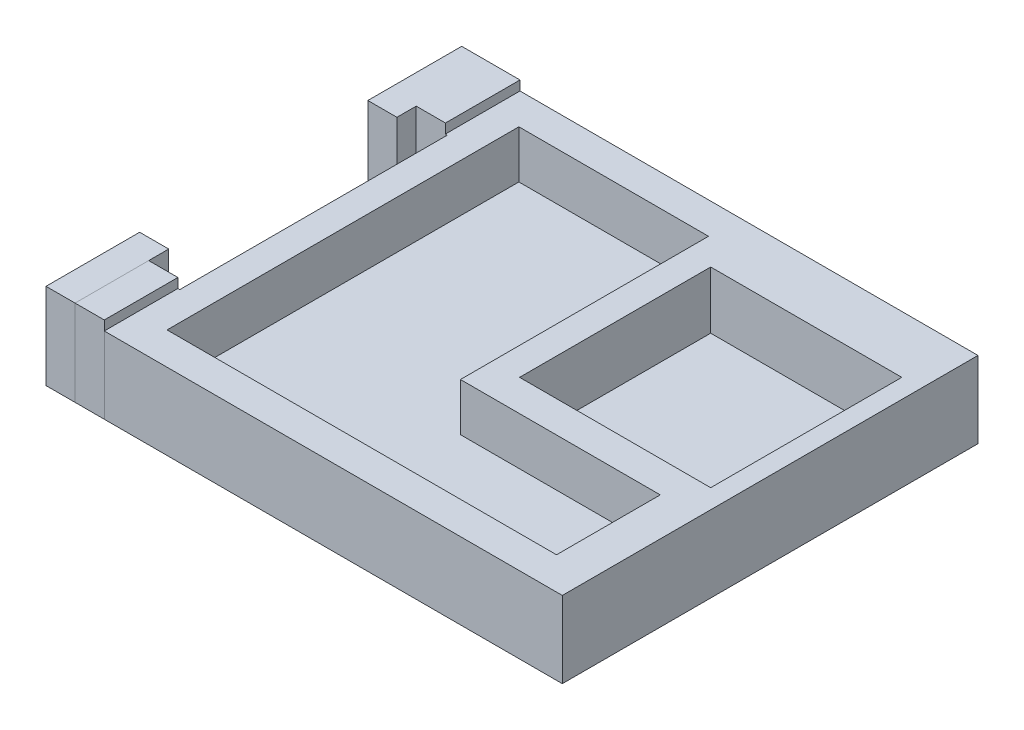
ISO-10303-21;
HEADER;
FILE_DESCRIPTION(('STEP AP214'),'2;1');
FILE_NAME('part.step','',(''),(''),'','','');
FILE_SCHEMA(('AUTOMOTIVE_DESIGN { 1 0 10303 214 1 1 1 1 }'));
ENDSEC;
DATA;
#1=APPLICATION_CONTEXT('core data for automotive mechanical design processes');
#2=APPLICATION_PROTOCOL_DEFINITION('international standard','automotive_design',2000,#1);
#3=PRODUCT_CONTEXT('',#1,'mechanical');
#4=PRODUCT('Part','Part','',(#3));
#5=PRODUCT_RELATED_PRODUCT_CATEGORY('part','',(#4));
#6=PRODUCT_DEFINITION_FORMATION('','',#4);
#7=PRODUCT_DEFINITION_CONTEXT('part definition',#1,'design');
#8=PRODUCT_DEFINITION('design','',#6,#7);
#9=PRODUCT_DEFINITION_SHAPE('','',#8);
#10=(LENGTH_UNIT() NAMED_UNIT(*) SI_UNIT(.MILLI.,.METRE.));
#11=(NAMED_UNIT(*) PLANE_ANGLE_UNIT() SI_UNIT($,.RADIAN.));
#12=(NAMED_UNIT(*) SI_UNIT($,.STERADIAN.) SOLID_ANGLE_UNIT());
#13=UNCERTAINTY_MEASURE_WITH_UNIT(LENGTH_MEASURE(1.E-05),#10,'distance_accuracy_value','');
#14=(GEOMETRIC_REPRESENTATION_CONTEXT(3) GLOBAL_UNCERTAINTY_ASSIGNED_CONTEXT((#13)) GLOBAL_UNIT_ASSIGNED_CONTEXT((#10,
#11,#12)) REPRESENTATION_CONTEXT('',''));
#15=CARTESIAN_POINT('',(0.,0.,0.));
#16=DIRECTION('',(0.,0.,1.));
#17=DIRECTION('',(1.,0.,0.));
#18=AXIS2_PLACEMENT_3D('',#15,#16,#17);
#19=CARTESIAN_POINT('',(-51.7142218353423,7.00000000000001,1.78412162468005));
#20=DIRECTION('',(0.,1.,0.));
#21=DIRECTION('',(0.,0.,-1.));
#22=AXIS2_PLACEMENT_3D('',#19,#20,#21);
#23=PLANE('',#22);
#24=DIRECTION('',(1.,0.,0.));
#25=VECTOR('',#24,1.);
#26=CARTESIAN_POINT('',(-54.9142218353423,6.99999999999999,-31.7158783753189));
#27=LINE('',#26,#25);
#28=CARTESIAN_POINT('',(-54.9142218353423,6.99999999999999,-31.7158783753189));
#29=VERTEX_POINT('',#28);
#30=CARTESIAN_POINT('',(-48.8142218353423,6.99999999999999,-31.7158783753189));
#31=VERTEX_POINT('',#30);
#32=EDGE_CURVE('E55',#29,#31,#27,.T.);
#33=ORIENTED_EDGE('',*,*,#32,.F.);
#34=DIRECTION('',(0.,0.,1.));
#35=VECTOR('',#34,1.);
#36=CARTESIAN_POINT('',(-54.9142218353423,6.99999999999999,-31.7158783753189));
#37=LINE('',#36,#35);
#38=CARTESIAN_POINT('',(-54.9142218353423,7.,-21.8957467152052));
#39=VERTEX_POINT('',#38);
#40=EDGE_CURVE('E88',#29,#39,#37,.T.);
#41=ORIENTED_EDGE('',*,*,#40,.T.);
#42=DIRECTION('',(1.,0.,0.));
#43=VECTOR('',#42,1.);
#44=CARTESIAN_POINT('',(-54.9142218353423,7.,-21.8957467152052));
#45=LINE('',#44,#43);
#46=CARTESIAN_POINT('',(-51.8720248838093,7.,-21.8957467152052));
#47=VERTEX_POINT('',#46);
#48=EDGE_CURVE('E82',#39,#47,#45,.T.);
#49=ORIENTED_EDGE('',*,*,#48,.T.);
#50=DIRECTION('',(0.,0.,1.));
#51=VECTOR('',#50,1.);
#52=CARTESIAN_POINT('',(-51.8720248838093,7.,-23.9158783753189));
#53=LINE('',#52,#51);
#54=CARTESIAN_POINT('',(-51.8720248838093,7.,-23.9158783753189));
#55=VERTEX_POINT('',#54);
#56=EDGE_CURVE('E85',#55,#47,#53,.T.);
#57=ORIENTED_EDGE('',*,*,#56,.F.);
#58=DIRECTION('',(1.,0.,0.));
#59=VECTOR('',#58,1.);
#60=CARTESIAN_POINT('',(-51.8720248838093,7.,-23.9158783753189));
#61=LINE('',#60,#59);
#62=CARTESIAN_POINT('',(-48.8142218353423,7.,-23.9158783753189));
#63=VERTEX_POINT('',#62);
#64=EDGE_CURVE('E68',#55,#63,#61,.T.);
#65=ORIENTED_EDGE('',*,*,#64,.T.);
#66=DIRECTION('',(0.,0.,1.));
#67=VECTOR('',#66,1.);
#68=CARTESIAN_POINT('',(-48.8142218353423,6.99999999999999,-31.7158783753189));
#69=LINE('',#68,#67);
#70=EDGE_CURVE('E62',#31,#63,#69,.T.);
#71=ORIENTED_EDGE('',*,*,#70,.F.);
#72=EDGE_LOOP('',(#33,#41,#49,#57,#65,#71));
#73=FACE_BOUND('',#72,.T.);
#74=ADVANCED_FACE('F48',(#73),#23,.T.);
#75=CARTESIAN_POINT('',(-48.8142218353423,18.5604924558588,-31.7158783753189));
#76=DIRECTION('',(1.,0.,0.));
#77=DIRECTION('',(0.,0.,-1.));
#78=AXIS2_PLACEMENT_3D('',#75,#76,#77);
#79=PLANE('',#78);
#80=DIRECTION('',(0.,-1.,0.));
#81=VECTOR('',#80,1.);
#82=CARTESIAN_POINT('',(-48.8142218353423,18.5604924558588,-31.7158783753189));
#83=LINE('',#82,#81);
#84=CARTESIAN_POINT('',(-48.8142218353423,-2.,-31.7158783753189));
#85=VERTEX_POINT('',#84);
#86=EDGE_CURVE('E13',#31,#85,#83,.T.);
#87=ORIENTED_EDGE('',*,*,#86,.F.);
#88=ORIENTED_EDGE('',*,*,#70,.T.);
#89=DIRECTION('',(0.,-1.,0.));
#90=VECTOR('',#89,1.);
#91=CARTESIAN_POINT('',(-48.8142218353423,18.5604924558588,-23.9158783753189));
#92=LINE('',#91,#90);
#93=CARTESIAN_POINT('',(-48.8142218353423,-2.,-23.9158783753189));
#94=VERTEX_POINT('',#93);
#95=EDGE_CURVE('E109',#63,#94,#92,.T.);
#96=ORIENTED_EDGE('',*,*,#95,.T.);
#97=DIRECTION('',(0.,0.,-1.));
#98=VECTOR('',#97,1.);
#99=CARTESIAN_POINT('',(-48.8142218353423,-2.,-31.7158783753189));
#100=LINE('',#99,#98);
#101=EDGE_CURVE('E134',#94,#85,#100,.T.);
#102=ORIENTED_EDGE('',*,*,#101,.T.);
#103=EDGE_LOOP('',(#87,#88,#96,#102));
#104=FACE_BOUND('',#103,.T.);
#105=ADVANCED_FACE('F152',(#104),#79,.T.);
#106=CARTESIAN_POINT('',(-51.8720248838093,18.5604924558588,-23.9158783753189));
#107=DIRECTION('',(0.,0.,-1.));
#108=DIRECTION('',(-1.,0.,0.));
#109=AXIS2_PLACEMENT_3D('',#106,#107,#108);
#110=PLANE('',#109);
#111=ORIENTED_EDGE('',*,*,#64,.F.);
#112=DIRECTION('',(0.,-1.,0.));
#113=VECTOR('',#112,1.);
#114=CARTESIAN_POINT('',(-51.8720248838093,18.5604924558588,-23.9158783753189));
#115=LINE('',#114,#113);
#116=CARTESIAN_POINT('',(-51.8720248838093,-2.,-23.9158783753189));
#117=VERTEX_POINT('',#116);
#118=EDGE_CURVE('E107',#55,#117,#115,.T.);
#119=ORIENTED_EDGE('',*,*,#118,.T.);
#120=DIRECTION('',(-1.,0.,0.));
#121=VECTOR('',#120,1.);
#122=CARTESIAN_POINT('',(-51.8720248838093,-2.,-23.9158783753189));
#123=LINE('',#122,#121);
#124=EDGE_CURVE('E137',#94,#117,#123,.T.);
#125=ORIENTED_EDGE('',*,*,#124,.F.);
#126=ORIENTED_EDGE('',*,*,#95,.F.);
#127=EDGE_LOOP('',(#111,#119,#125,#126));
#128=FACE_BOUND('',#127,.T.);
#129=ADVANCED_FACE('F157',(#128),#110,.F.);
#130=CARTESIAN_POINT('',(-51.8720248838093,18.5604924558588,-23.9158783753189));
#131=DIRECTION('',(1.,0.,0.));
#132=DIRECTION('',(0.,0.,-1.));
#133=AXIS2_PLACEMENT_3D('',#130,#131,#132);
#134=PLANE('',#133);
#135=ORIENTED_EDGE('',*,*,#118,.F.);
#136=ORIENTED_EDGE('',*,*,#56,.T.);
#137=DIRECTION('',(0.,-1.,0.));
#138=VECTOR('',#137,1.);
#139=CARTESIAN_POINT('',(-51.8720248838093,18.5604924558588,-21.8957467152052));
#140=LINE('',#139,#138);
#141=CARTESIAN_POINT('',(-51.8720248838093,-2.,-21.8957467152052));
#142=VERTEX_POINT('',#141);
#143=EDGE_CURVE('E95',#47,#142,#140,.T.);
#144=ORIENTED_EDGE('',*,*,#143,.T.);
#145=DIRECTION('',(0.,0.,-1.));
#146=VECTOR('',#145,1.);
#147=CARTESIAN_POINT('',(-51.8720248838093,-2.,-23.9158783753189));
#148=LINE('',#147,#146);
#149=EDGE_CURVE('E142',#142,#117,#148,.T.);
#150=ORIENTED_EDGE('',*,*,#149,.T.);
#151=EDGE_LOOP('',(#135,#136,#144,#150));
#152=FACE_BOUND('',#151,.T.);
#153=ADVANCED_FACE('F105',(#152),#134,.T.);
#154=CARTESIAN_POINT('',(-54.9142218353423,18.5604924558588,-21.8957467152052));
#155=DIRECTION('',(0.,0.,-1.));
#156=DIRECTION('',(-1.,0.,0.));
#157=AXIS2_PLACEMENT_3D('',#154,#155,#156);
#158=PLANE('',#157);
#159=ORIENTED_EDGE('',*,*,#48,.F.);
#160=DIRECTION('',(0.,-1.,0.));
#161=VECTOR('',#160,1.);
#162=CARTESIAN_POINT('',(-54.9142218353423,18.5604924558588,-21.8957467152052));
#163=LINE('',#162,#161);
#164=CARTESIAN_POINT('',(-54.9142218353423,-2.,-21.8957467152052));
#165=VERTEX_POINT('',#164);
#166=EDGE_CURVE('E103',#39,#165,#163,.T.);
#167=ORIENTED_EDGE('',*,*,#166,.T.);
#168=DIRECTION('',(-1.,0.,0.));
#169=VECTOR('',#168,1.);
#170=CARTESIAN_POINT('',(-54.9142218353423,-2.,-21.8957467152052));
#171=LINE('',#170,#169);
#172=EDGE_CURVE('E99',#142,#165,#171,.T.);
#173=ORIENTED_EDGE('',*,*,#172,.F.);
#174=ORIENTED_EDGE('',*,*,#143,.F.);
#175=EDGE_LOOP('',(#159,#167,#173,#174));
#176=FACE_BOUND('',#175,.T.);
#177=ADVANCED_FACE('F96',(#176),#158,.F.);
#178=CARTESIAN_POINT('',(-54.9142218353423,18.5604924558588,-31.7158783753189));
#179=DIRECTION('',(1.,0.,0.));
#180=DIRECTION('',(0.,0.,-1.));
#181=AXIS2_PLACEMENT_3D('',#178,#179,#180);
#182=PLANE('',#181);
#183=ORIENTED_EDGE('',*,*,#40,.F.);
#184=DIRECTION('',(0.,-1.,0.));
#185=VECTOR('',#184,1.);
#186=CARTESIAN_POINT('',(-54.9142218353423,18.5604924558588,-31.7158783753189));
#187=LINE('',#186,#185);
#188=CARTESIAN_POINT('',(-54.9142218353423,-2.,-31.7158783753189));
#189=VERTEX_POINT('',#188);
#190=EDGE_CURVE('E114',#29,#189,#187,.T.);
#191=ORIENTED_EDGE('',*,*,#190,.T.);
#192=DIRECTION('',(0.,0.,-1.));
#193=VECTOR('',#192,1.);
#194=CARTESIAN_POINT('',(-54.9142218353423,-2.,-31.7158783753189));
#195=LINE('',#194,#193);
#196=EDGE_CURVE('E125',#165,#189,#195,.T.);
#197=ORIENTED_EDGE('',*,*,#196,.F.);
#198=ORIENTED_EDGE('',*,*,#166,.F.);
#199=EDGE_LOOP('',(#183,#191,#197,#198));
#200=FACE_BOUND('',#199,.T.);
#201=ADVANCED_FACE('F149',(#200),#182,.F.);
#202=CARTESIAN_POINT('',(-54.9142218353423,18.5604924558588,-31.7158783753189));
#203=DIRECTION('',(0.,0.,-1.));
#204=DIRECTION('',(-1.,0.,0.));
#205=AXIS2_PLACEMENT_3D('',#202,#203,#204);
#206=PLANE('',#205);
#207=ORIENTED_EDGE('',*,*,#190,.F.);
#208=ORIENTED_EDGE('',*,*,#32,.T.);
#209=ORIENTED_EDGE('',*,*,#86,.T.);
#210=DIRECTION('',(-1.,0.,0.));
#211=VECTOR('',#210,1.);
#212=CARTESIAN_POINT('',(-54.9142218353423,-2.,-31.7158783753189));
#213=LINE('',#212,#211);
#214=EDGE_CURVE('E128',#85,#189,#213,.T.);
#215=ORIENTED_EDGE('',*,*,#214,.T.);
#216=EDGE_LOOP('',(#207,#208,#209,#215));
#217=FACE_BOUND('',#216,.T.);
#218=ADVANCED_FACE('F151',(#217),#206,.T.);
#219=CARTESIAN_POINT('',(0.,-2.,0.));
#220=DIRECTION('',(0.,1.,0.));
#221=DIRECTION('',(0.,0.,1.));
#222=AXIS2_PLACEMENT_3D('',#219,#220,#221);
#223=PLANE('',#222);
#224=ORIENTED_EDGE('',*,*,#101,.F.);
#225=ORIENTED_EDGE('',*,*,#124,.T.);
#226=ORIENTED_EDGE('',*,*,#149,.F.);
#227=ORIENTED_EDGE('',*,*,#172,.T.);
#228=ORIENTED_EDGE('',*,*,#196,.T.);
#229=ORIENTED_EDGE('',*,*,#214,.F.);
#230=EDGE_LOOP('',(#224,#225,#226,#227,#228,#229));
#231=FACE_BOUND('',#230,.T.);
#232=ADVANCED_FACE('F145',(#231),#223,.F.);
#233=CLOSED_SHELL('',(#74,#105,#129,#153,#177,#201,#218,#232));
#234=MANIFOLD_SOLID_BREP('B2',#233);
#235=CARTESIAN_POINT('',(-59.4142218353423,5.02438618072299,1.98412162468005));
#236=DIRECTION('',(0.,0.,-1.));
#237=DIRECTION('',(-1.,0.,0.));
#238=AXIS2_PLACEMENT_3D('',#235,#236,#237);
#239=PLANE('',#238);
#240=DIRECTION('',(0.,1.,0.));
#241=VECTOR('',#240,1.);
#242=CARTESIAN_POINT('',(-51.8720248838093,7.00000000000001,1.98412162468004));
#243=LINE('',#242,#241);
#244=CARTESIAN_POINT('',(-51.8720248838093,-2.,1.98412162468005));
#245=VERTEX_POINT('',#244);
#246=CARTESIAN_POINT('',(-51.8720248838093,7.00000000000001,1.98412162468004));
#247=VERTEX_POINT('',#246);
#248=EDGE_CURVE('E245',#245,#247,#243,.T.);
#249=ORIENTED_EDGE('',*,*,#248,.F.);
#250=DIRECTION('',(1.,0.,0.));
#251=VECTOR('',#250,1.);
#252=CARTESIAN_POINT('',(-51.8720248838093,-2.,1.98412162468005));
#253=LINE('',#252,#251);
#254=CARTESIAN_POINT('',(-54.9142218353423,-2.,1.98412162468005));
#255=VERTEX_POINT('',#254);
#256=EDGE_CURVE('E268',#255,#245,#253,.T.);
#257=ORIENTED_EDGE('',*,*,#256,.F.);
#258=DIRECTION('',(0.,-1.,0.));
#259=VECTOR('',#258,1.);
#260=CARTESIAN_POINT('',(-54.9142218353423,7.00000000000002,1.98412162468005));
#261=LINE('',#260,#259);
#262=CARTESIAN_POINT('',(-54.9142218353423,7.00000000000001,1.98412162468005));
#263=VERTEX_POINT('',#262);
#264=EDGE_CURVE('E273',#263,#255,#261,.T.);
#265=ORIENTED_EDGE('',*,*,#264,.F.);
#266=DIRECTION('',(-1.,0.,0.));
#267=VECTOR('',#266,1.);
#268=CARTESIAN_POINT('',(-51.8720248838093,7.00000000000001,1.98412162468004));
#269=LINE('',#268,#267);
#270=EDGE_CURVE('E288',#247,#263,#269,.T.);
#271=ORIENTED_EDGE('',*,*,#270,.F.);
#272=EDGE_LOOP('',(#249,#257,#265,#271));
#273=FACE_BOUND('',#272,.T.);
#274=ADVANCED_FACE('F237',(#273),#239,.T.);
#275=CARTESIAN_POINT('',(0.,0.,11.784121624679));
#276=DIRECTION('',(0.,0.,-1.));
#277=DIRECTION('',(-1.,0.,0.));
#278=AXIS2_PLACEMENT_3D('',#275,#276,#277);
#279=PLANE('',#278);
#280=DIRECTION('',(0.,1.,0.));
#281=VECTOR('',#280,1.);
#282=CARTESIAN_POINT('',(-51.8720248838093,7.00000000000001,11.784121624679));
#283=LINE('',#282,#281);
#284=CARTESIAN_POINT('',(-51.8720248838093,-2.,11.784121624679));
#285=VERTEX_POINT('',#284);
#286=CARTESIAN_POINT('',(-51.8720248838093,7.00000000000001,11.784121624679));
#287=VERTEX_POINT('',#286);
#288=EDGE_CURVE('E297',#285,#287,#283,.T.);
#289=ORIENTED_EDGE('',*,*,#288,.T.);
#290=DIRECTION('',(-1.,0.,0.));
#291=VECTOR('',#290,1.);
#292=CARTESIAN_POINT('',(-51.8720248838093,7.00000000000001,11.784121624679));
#293=LINE('',#292,#291);
#294=CARTESIAN_POINT('',(-54.9142218353423,7.00000000000001,11.784121624679));
#295=VERTEX_POINT('',#294);
#296=EDGE_CURVE('E286',#287,#295,#293,.T.);
#297=ORIENTED_EDGE('',*,*,#296,.T.);
#298=DIRECTION('',(0.,-1.,0.));
#299=VECTOR('',#298,1.);
#300=CARTESIAN_POINT('',(-54.9142218353423,7.00000000000001,11.784121624679));
#301=LINE('',#300,#299);
#302=CARTESIAN_POINT('',(-54.9142218353423,-2.,11.784121624679));
#303=VERTEX_POINT('',#302);
#304=EDGE_CURVE('E289',#295,#303,#301,.T.);
#305=ORIENTED_EDGE('',*,*,#304,.T.);
#306=DIRECTION('',(1.,0.,0.));
#307=VECTOR('',#306,1.);
#308=CARTESIAN_POINT('',(-51.8720248838093,-2.,11.784121624679));
#309=LINE('',#308,#307);
#310=EDGE_CURVE('E294',#303,#285,#309,.T.);
#311=ORIENTED_EDGE('',*,*,#310,.T.);
#312=EDGE_LOOP('',(#289,#297,#305,#311));
#313=FACE_BOUND('',#312,.T.);
#314=ADVANCED_FACE('F296',(#313),#279,.F.);
#315=CARTESIAN_POINT('',(-51.8720248838093,7.00000000000001,-7.71613954498877));
#316=DIRECTION('',(0.,1.,0.));
#317=DIRECTION('',(-1.,0.,0.));
#318=AXIS2_PLACEMENT_3D('',#315,#316,#317);
#319=PLANE('',#318);
#320=DIRECTION('',(0.,0.,1.));
#321=VECTOR('',#320,1.);
#322=CARTESIAN_POINT('',(-51.8720248838093,7.00000000000001,-7.71613954498877));
#323=LINE('',#322,#321);
#324=EDGE_CURVE('E46',#247,#287,#323,.T.);
#325=ORIENTED_EDGE('',*,*,#324,.F.);
#326=ORIENTED_EDGE('',*,*,#270,.T.);
#327=DIRECTION('',(0.,0.,1.));
#328=VECTOR('',#327,1.);
#329=CARTESIAN_POINT('',(-54.9142218353423,7.00000000000001,-7.71613954498877));
#330=LINE('',#329,#328);
#331=EDGE_CURVE('E283',#263,#295,#330,.T.);
#332=ORIENTED_EDGE('',*,*,#331,.T.);
#333=ORIENTED_EDGE('',*,*,#296,.F.);
#334=EDGE_LOOP('',(#325,#326,#332,#333));
#335=FACE_BOUND('',#334,.T.);
#336=ADVANCED_FACE('F284',(#335),#319,.T.);
#337=CARTESIAN_POINT('',(-54.9142218353423,7.00000000000001,-7.71613954498877));
#338=DIRECTION('',(-1.,0.,0.));
#339=DIRECTION('',(0.,0.,1.));
#340=AXIS2_PLACEMENT_3D('',#337,#338,#339);
#341=PLANE('',#340);
#342=ORIENTED_EDGE('',*,*,#331,.F.);
#343=ORIENTED_EDGE('',*,*,#264,.T.);
#344=DIRECTION('',(0.,0.,1.));
#345=VECTOR('',#344,1.);
#346=CARTESIAN_POINT('',(-54.9142218353423,-2.,-7.71613954498877));
#347=LINE('',#346,#345);
#348=EDGE_CURVE('E278',#255,#303,#347,.T.);
#349=ORIENTED_EDGE('',*,*,#348,.T.);
#350=ORIENTED_EDGE('',*,*,#304,.F.);
#351=EDGE_LOOP('',(#342,#343,#349,#350));
#352=FACE_BOUND('',#351,.T.);
#353=ADVANCED_FACE('F290',(#352),#341,.T.);
#354=CARTESIAN_POINT('',(-51.8720248838093,-2.,-7.71613954498877));
#355=DIRECTION('',(0.,-1.,0.));
#356=DIRECTION('',(1.,0.,0.));
#357=AXIS2_PLACEMENT_3D('',#354,#355,#356);
#358=PLANE('',#357);
#359=ORIENTED_EDGE('',*,*,#348,.F.);
#360=ORIENTED_EDGE('',*,*,#256,.T.);
#361=DIRECTION('',(0.,0.,1.));
#362=VECTOR('',#361,1.);
#363=CARTESIAN_POINT('',(-51.8720248838093,-2.,-7.71613954498877));
#364=LINE('',#363,#362);
#365=EDGE_CURVE('E304',#245,#285,#364,.T.);
#366=ORIENTED_EDGE('',*,*,#365,.T.);
#367=ORIENTED_EDGE('',*,*,#310,.F.);
#368=EDGE_LOOP('',(#359,#360,#366,#367));
#369=FACE_BOUND('',#368,.T.);
#370=ADVANCED_FACE('F310',(#369),#358,.T.);
#371=CARTESIAN_POINT('',(-51.8720248838093,7.00000000000001,-7.71613954498877));
#372=DIRECTION('',(1.,0.,0.));
#373=DIRECTION('',(0.,0.,-1.));
#374=AXIS2_PLACEMENT_3D('',#371,#372,#373);
#375=PLANE('',#374);
#376=ORIENTED_EDGE('',*,*,#365,.F.);
#377=ORIENTED_EDGE('',*,*,#248,.T.);
#378=ORIENTED_EDGE('',*,*,#324,.T.);
#379=ORIENTED_EDGE('',*,*,#288,.F.);
#380=EDGE_LOOP('',(#376,#377,#378,#379));
#381=FACE_BOUND('',#380,.T.);
#382=ADVANCED_FACE('F311',(#381),#375,.T.);
#383=CLOSED_SHELL('',(#274,#314,#336,#353,#370,#382));
#384=MANIFOLD_SOLID_BREP('B7',#383);
#385=CARTESIAN_POINT('',(-51.7142218353423,7.00000000000001,1.78412162468005));
#386=DIRECTION('',(0.,1.,0.));
#387=DIRECTION('',(0.,0.,-1.));
#388=AXIS2_PLACEMENT_3D('',#385,#386,#387);
#389=PLANE('',#388);
#390=DIRECTION('',(1.,0.,0.));
#391=VECTOR('',#390,1.);
#392=CARTESIAN_POINT('',(-51.8720248838093,7.00000000000001,4.08162198891659));
#393=LINE('',#392,#391);
#394=CARTESIAN_POINT('',(-51.8720248838093,7.00000000000001,4.08162198891659));
#395=VERTEX_POINT('',#394);
#396=CARTESIAN_POINT('',(-48.8142218353423,7.00000000000001,4.08162198891659));
#397=VERTEX_POINT('',#396);
#398=EDGE_CURVE('E378',#395,#397,#393,.T.);
#399=ORIENTED_EDGE('',*,*,#398,.F.);
#400=DIRECTION('',(0.,0.,1.));
#401=VECTOR('',#400,1.);
#402=CARTESIAN_POINT('',(-51.8720248838093,7.00000000000001,4.0816219889166));
#403=LINE('',#402,#401);
#404=CARTESIAN_POINT('',(-51.8720248838093,7.00000000000001,11.784121624679));
#405=VERTEX_POINT('',#404);
#406=EDGE_CURVE('E432',#395,#405,#403,.T.);
#407=ORIENTED_EDGE('',*,*,#406,.T.);
#408=DIRECTION('',(1.,0.,0.));
#409=VECTOR('',#408,1.);
#410=CARTESIAN_POINT('',(-51.8720248838093,7.00000000000001,11.784121624679));
#411=LINE('',#410,#409);
#412=CARTESIAN_POINT('',(-48.8142218353423,7.00000000000001,11.784121624679));
#413=VERTEX_POINT('',#412);
#414=EDGE_CURVE('E391',#405,#413,#411,.T.);
#415=ORIENTED_EDGE('',*,*,#414,.T.);
#416=DIRECTION('',(0.,0.,1.));
#417=VECTOR('',#416,1.);
#418=CARTESIAN_POINT('',(-48.8142218353423,7.00000000000001,4.0816219889166));
#419=LINE('',#418,#417);
#420=EDGE_CURVE('E385',#397,#413,#419,.T.);
#421=ORIENTED_EDGE('',*,*,#420,.F.);
#422=EDGE_LOOP('',(#399,#407,#415,#421));
#423=FACE_BOUND('',#422,.T.);
#424=ADVANCED_FACE('F371',(#423),#389,.T.);
#425=CARTESIAN_POINT('',(-48.8142218353423,15.4872589028058,4.08162198891659));
#426=DIRECTION('',(1.,0.,0.));
#427=DIRECTION('',(0.,0.,-1.));
#428=AXIS2_PLACEMENT_3D('',#425,#426,#427);
#429=PLANE('',#428);
#430=DIRECTION('',(0.,-1.,0.));
#431=VECTOR('',#430,1.);
#432=CARTESIAN_POINT('',(-48.8142218353423,15.4872589028058,4.08162198891659));
#433=LINE('',#432,#431);
#434=CARTESIAN_POINT('',(-48.8142218353423,-2.,4.08162198891659));
#435=VERTEX_POINT('',#434);
#436=EDGE_CURVE('E235',#397,#435,#433,.T.);
#437=ORIENTED_EDGE('',*,*,#436,.F.);
#438=ORIENTED_EDGE('',*,*,#420,.T.);
#439=DIRECTION('',(0.,-1.,0.));
#440=VECTOR('',#439,1.);
#441=CARTESIAN_POINT('',(-48.8142218353423,15.4872589028058,11.784121624679));
#442=LINE('',#441,#440);
#443=CARTESIAN_POINT('',(-48.8142218353423,-2.,11.784121624679));
#444=VERTEX_POINT('',#443);
#445=EDGE_CURVE('E403',#413,#444,#442,.T.);
#446=ORIENTED_EDGE('',*,*,#445,.T.);
#447=DIRECTION('',(0.,0.,-1.));
#448=VECTOR('',#447,1.);
#449=CARTESIAN_POINT('',(-48.8142218353423,-2.,4.08162198891659));
#450=LINE('',#449,#448);
#451=EDGE_CURVE('E429',#444,#435,#450,.T.);
#452=ORIENTED_EDGE('',*,*,#451,.T.);
#453=EDGE_LOOP('',(#437,#438,#446,#452));
#454=FACE_BOUND('',#453,.T.);
#455=ADVANCED_FACE('F445',(#454),#429,.T.);
#456=CARTESIAN_POINT('',(-51.8720248838093,15.4872589028058,11.784121624679));
#457=DIRECTION('',(0.,0.,-1.));
#458=DIRECTION('',(-1.,0.,0.));
#459=AXIS2_PLACEMENT_3D('',#456,#457,#458);
#460=PLANE('',#459);
#461=ORIENTED_EDGE('',*,*,#414,.F.);
#462=DIRECTION('',(0.,-1.,0.));
#463=VECTOR('',#462,1.);
#464=CARTESIAN_POINT('',(-51.8720248838093,15.4872589028058,11.784121624679));
#465=LINE('',#464,#463);
#466=CARTESIAN_POINT('',(-51.8720248838093,-2.,11.784121624679));
#467=VERTEX_POINT('',#466);
#468=EDGE_CURVE('E419',#405,#467,#465,.T.);
#469=ORIENTED_EDGE('',*,*,#468,.T.);
#470=DIRECTION('',(-1.,0.,0.));
#471=VECTOR('',#470,1.);
#472=CARTESIAN_POINT('',(-51.8720248838093,-2.,11.784121624679));
#473=LINE('',#472,#471);
#474=EDGE_CURVE('E422',#444,#467,#473,.T.);
#475=ORIENTED_EDGE('',*,*,#474,.F.);
#476=ORIENTED_EDGE('',*,*,#445,.F.);
#477=EDGE_LOOP('',(#461,#469,#475,#476));
#478=FACE_BOUND('',#477,.T.);
#479=ADVANCED_FACE('F421',(#478),#460,.F.);
#480=CARTESIAN_POINT('',(-51.8720248838093,15.4872589028058,4.08162198891659));
#481=DIRECTION('',(1.,0.,0.));
#482=DIRECTION('',(0.,0.,-1.));
#483=AXIS2_PLACEMENT_3D('',#480,#481,#482);
#484=PLANE('',#483);
#485=ORIENTED_EDGE('',*,*,#406,.F.);
#486=DIRECTION('',(0.,-1.,0.));
#487=VECTOR('',#486,1.);
#488=CARTESIAN_POINT('',(-51.8720248838093,15.4872589028058,4.08162198891659));
#489=LINE('',#488,#487);
#490=CARTESIAN_POINT('',(-51.8720248838093,-2.,4.08162198891659));
#491=VERTEX_POINT('',#490);
#492=EDGE_CURVE('E410',#395,#491,#489,.T.);
#493=ORIENTED_EDGE('',*,*,#492,.T.);
#494=DIRECTION('',(0.,0.,-1.));
#495=VECTOR('',#494,1.);
#496=CARTESIAN_POINT('',(-51.8720248838093,-2.,4.08162198891659));
#497=LINE('',#496,#495);
#498=EDGE_CURVE('E427',#467,#491,#497,.T.);
#499=ORIENTED_EDGE('',*,*,#498,.F.);
#500=ORIENTED_EDGE('',*,*,#468,.F.);
#501=EDGE_LOOP('',(#485,#493,#499,#500));
#502=FACE_BOUND('',#501,.T.);
#503=ADVANCED_FACE('F431',(#502),#484,.F.);
#504=CARTESIAN_POINT('',(-51.8720248838093,15.4872589028058,4.08162198891659));
#505=DIRECTION('',(0.,0.,-1.));
#506=DIRECTION('',(-1.,0.,0.));
#507=AXIS2_PLACEMENT_3D('',#504,#505,#506);
#508=PLANE('',#507);
#509=ORIENTED_EDGE('',*,*,#492,.F.);
#510=ORIENTED_EDGE('',*,*,#398,.T.);
#511=ORIENTED_EDGE('',*,*,#436,.T.);
#512=DIRECTION('',(-1.,0.,0.));
#513=VECTOR('',#512,1.);
#514=CARTESIAN_POINT('',(-51.8720248838093,-2.,4.08162198891659));
#515=LINE('',#514,#513);
#516=EDGE_CURVE('E433',#435,#491,#515,.T.);
#517=ORIENTED_EDGE('',*,*,#516,.T.);
#518=EDGE_LOOP('',(#509,#510,#511,#517));
#519=FACE_BOUND('',#518,.T.);
#520=ADVANCED_FACE('F444',(#519),#508,.T.);
#521=CARTESIAN_POINT('',(0.,-2.,0.));
#522=DIRECTION('',(0.,1.,0.));
#523=DIRECTION('',(0.,0.,1.));
#524=AXIS2_PLACEMENT_3D('',#521,#522,#523);
#525=PLANE('',#524);
#526=ORIENTED_EDGE('',*,*,#451,.F.);
#527=ORIENTED_EDGE('',*,*,#474,.T.);
#528=ORIENTED_EDGE('',*,*,#498,.T.);
#529=ORIENTED_EDGE('',*,*,#516,.F.);
#530=EDGE_LOOP('',(#526,#527,#528,#529));
#531=FACE_BOUND('',#530,.T.);
#532=ADVANCED_FACE('F425',(#531),#525,.F.);
#533=CLOSED_SHELL('',(#424,#455,#479,#503,#520,#532));
#534=MANIFOLD_SOLID_BREP('B40',#533);
#535=CARTESIAN_POINT('',(0.,6.,0.));
#536=DIRECTION('',(0.,-1.,0.));
#537=DIRECTION('',(0.,0.,-1.));
#538=AXIS2_PLACEMENT_3D('',#535,#536,#537);
#539=PLANE('',#538);
#540=DIRECTION('',(0.,0.,1.));
#541=VECTOR('',#540,1.);
#542=CARTESIAN_POINT('',(-22.8851351351351,6.,-25.7432432432433));
#543=LINE('',#542,#541);
#544=CARTESIAN_POINT('',(-22.8851351351351,6.,-25.7432432432433));
#545=VERTEX_POINT('',#544);
#546=CARTESIAN_POINT('',(-22.8851351351351,6.,-5.74324324324326));
#547=VERTEX_POINT('',#546);
#548=EDGE_CURVE('E762',#545,#547,#543,.T.);
#549=ORIENTED_EDGE('',*,*,#548,.F.);
#550=DIRECTION('',(-1.,0.,0.));
#551=VECTOR('',#550,1.);
#552=CARTESIAN_POINT('',(-22.8851351351351,6.,-25.7432432432433));
#553=LINE('',#552,#551);
#554=CARTESIAN_POINT('',(-2.88513513513513,6.,-25.7432432432433));
#555=VERTEX_POINT('',#554);
#556=EDGE_CURVE('E759',#555,#545,#553,.T.);
#557=ORIENTED_EDGE('',*,*,#556,.F.);
#558=DIRECTION('',(0.,0.,-1.));
#559=VECTOR('',#558,1.);
#560=CARTESIAN_POINT('',(-2.88513513513513,6.,-25.7432432432433));
#561=LINE('',#560,#559);
#562=CARTESIAN_POINT('',(-2.88513513513513,6.,-5.74324324324326));
#563=VERTEX_POINT('',#562);
#564=EDGE_CURVE('E770',#563,#555,#561,.T.);
#565=ORIENTED_EDGE('',*,*,#564,.F.);
#566=DIRECTION('',(1.,0.,0.));
#567=VECTOR('',#566,1.);
#568=CARTESIAN_POINT('',(-22.8851351351351,6.,-5.74324324324326));
#569=LINE('',#568,#567);
#570=EDGE_CURVE('E773',#547,#563,#569,.T.);
#571=ORIENTED_EDGE('',*,*,#570,.F.);
#572=EDGE_LOOP('',(#549,#557,#565,#571));
#573=FACE_BOUND('',#572,.T.);
#574=DIRECTION('',(-1.,0.,0.));
#575=VECTOR('',#574,1.);
#576=CARTESIAN_POINT('',(-48.6142218353423,6.,-31.7158783753189));
#577=LINE('',#576,#575);
#578=CARTESIAN_POINT('',(-0.885135135135128,6.,-31.7158783753189));
#579=VERTEX_POINT('',#578);
#580=CARTESIAN_POINT('',(-48.8142218353573,6.,-31.7158783753189));
#581=VERTEX_POINT('',#580);
#582=EDGE_CURVE('E740',#579,#581,#577,.T.);
#583=ORIENTED_EDGE('',*,*,#582,.T.);
#584=DIRECTION('',(0.,0.,1.));
#585=VECTOR('',#584,1.);
#586=CARTESIAN_POINT('',(-48.8142218353573,6.,-31.7158783753189));
#587=LINE('',#586,#585);
#588=CARTESIAN_POINT('',(-48.8142218353573,6.,-23.9158783753189));
#589=VERTEX_POINT('',#588);
#590=EDGE_CURVE('E688',#581,#589,#587,.T.);
#591=ORIENTED_EDGE('',*,*,#590,.T.);
#592=DIRECTION('',(1.,0.,0.));
#593=VECTOR('',#592,1.);
#594=CARTESIAN_POINT('',(-500000.,6.,-23.9158783753189));
#595=LINE('',#594,#593);
#596=CARTESIAN_POINT('',(-48.6142218353423,6.,-23.9158783753189));
#597=VERTEX_POINT('',#596);
#598=EDGE_CURVE('E692',#589,#597,#595,.T.);
#599=ORIENTED_EDGE('',*,*,#598,.T.);
#600=DIRECTION('',(0.,0.,1.));
#601=VECTOR('',#600,1.);
#602=CARTESIAN_POINT('',(-48.6142218353423,6.,-31.7158783753189));
#603=LINE('',#602,#601);
#604=CARTESIAN_POINT('',(-48.6142218353423,6.,4.08162198891659));
#605=VERTEX_POINT('',#604);
#606=EDGE_CURVE('E710',#597,#605,#603,.T.);
#607=ORIENTED_EDGE('',*,*,#606,.T.);
#608=DIRECTION('',(1.,0.,0.));
#609=VECTOR('',#608,1.);
#610=CARTESIAN_POINT('',(-500000.,6.,4.08162198891659));
#611=LINE('',#610,#609);
#612=CARTESIAN_POINT('',(-48.8142218353573,6.,4.08162198891659));
#613=VERTEX_POINT('',#612);
#614=EDGE_CURVE('E673',#613,#605,#611,.T.);
#615=ORIENTED_EDGE('',*,*,#614,.F.);
#616=DIRECTION('',(0.,0.,1.));
#617=VECTOR('',#616,1.);
#618=CARTESIAN_POINT('',(-48.8142218353573,6.,11.784121624679));
#619=LINE('',#618,#617);
#620=CARTESIAN_POINT('',(-48.8142218353573,6.,11.784121624679));
#621=VERTEX_POINT('',#620);
#622=EDGE_CURVE('E680',#613,#621,#619,.T.);
#623=ORIENTED_EDGE('',*,*,#622,.T.);
#624=DIRECTION('',(1.,0.,0.));
#625=VECTOR('',#624,1.);
#626=CARTESIAN_POINT('',(-48.6142218353423,6.,11.784121624679));
#627=LINE('',#626,#625);
#628=CARTESIAN_POINT('',(-0.885135135135128,6.,11.784121624679));
#629=VERTEX_POINT('',#628);
#630=EDGE_CURVE('E726',#621,#629,#627,.T.);
#631=ORIENTED_EDGE('',*,*,#630,.T.);
#632=DIRECTION('',(0.,0.,-1.));
#633=VECTOR('',#632,1.);
#634=CARTESIAN_POINT('',(-0.885135135135128,6.,-31.7158783753189));
#635=LINE('',#634,#633);
#636=EDGE_CURVE('E709',#629,#579,#635,.T.);
#637=ORIENTED_EDGE('',*,*,#636,.T.);
#638=EDGE_LOOP('',(#583,#591,#599,#607,#615,#623,#631,#637));
#639=FACE_BOUND('',#638,.T.);
#640=DIRECTION('',(1.,0.,0.));
#641=VECTOR('',#640,1.);
#642=CARTESIAN_POINT('',(-45.6273849947735,6.,-28.4126355974941));
#643=LINE('',#642,#641);
#644=CARTESIAN_POINT('',(-45.6273849947735,6.,-28.4126355974941));
#645=VERTEX_POINT('',#644);
#646=CARTESIAN_POINT('',(-25.7828090986436,6.,-28.4126355974941));
#647=VERTEX_POINT('',#646);
#648=EDGE_CURVE('E513',#645,#647,#643,.T.);
#649=ORIENTED_EDGE('',*,*,#648,.T.);
#650=DIRECTION('',(0.,0.,1.));
#651=VECTOR('',#650,1.);
#652=CARTESIAN_POINT('',(-25.7828090986436,6.,-28.4126355974941));
#653=LINE('',#652,#651);
#654=CARTESIAN_POINT('',(-25.7828090986436,6.,-2.45330565868684));
#655=VERTEX_POINT('',#654);
#656=EDGE_CURVE('E633',#647,#655,#653,.T.);
#657=ORIENTED_EDGE('',*,*,#656,.T.);
#658=DIRECTION('',(1.,0.,0.));
#659=VECTOR('',#658,1.);
#660=CARTESIAN_POINT('',(-25.7828090986436,6.,-2.45330565868684));
#661=LINE('',#660,#659);
#662=CARTESIAN_POINT('',(-4.87208254726568,6.,-2.45330565868684));
#663=VERTEX_POINT('',#662);
#664=EDGE_CURVE('E639',#655,#663,#661,.T.);
#665=ORIENTED_EDGE('',*,*,#664,.T.);
#666=DIRECTION('',(0.,0.,-1.));
#667=VECTOR('',#666,1.);
#668=CARTESIAN_POINT('',(-4.87208254726568,6.,8.40334089776817));
#669=LINE('',#668,#667);
#670=CARTESIAN_POINT('',(-4.87208254726568,6.,8.40334089776817));
#671=VERTEX_POINT('',#670);
#672=EDGE_CURVE('E650',#671,#663,#669,.T.);
#673=ORIENTED_EDGE('',*,*,#672,.F.);
#674=DIRECTION('',(1.,0.,0.));
#675=VECTOR('',#674,1.);
#676=CARTESIAN_POINT('',(-45.6273849947735,6.,8.40334089776817));
#677=LINE('',#676,#675);
#678=CARTESIAN_POINT('',(-45.6273849947735,6.,8.40334089776817));
#679=VERTEX_POINT('',#678);
#680=EDGE_CURVE('E653',#679,#671,#677,.T.);
#681=ORIENTED_EDGE('',*,*,#680,.F.);
#682=DIRECTION('',(0.,0.,1.));
#683=VECTOR('',#682,1.);
#684=CARTESIAN_POINT('',(-45.6273849947735,6.,-28.4126355974941));
#685=LINE('',#684,#683);
#686=EDGE_CURVE('E644',#645,#679,#685,.T.);
#687=ORIENTED_EDGE('',*,*,#686,.F.);
#688=EDGE_LOOP('',(#649,#657,#665,#673,#681,#687));
#689=FACE_BOUND('',#688,.T.);
#690=ADVANCED_FACE('F496',(#573,#639,#689),#539,.F.);
#691=CARTESIAN_POINT('',(-48.6142218353423,-2.,-31.7158783753189));
#692=DIRECTION('',(-1.,0.,0.));
#693=DIRECTION('',(0.,0.,1.));
#694=AXIS2_PLACEMENT_3D('',#691,#692,#693);
#695=PLANE('',#694);
#696=DIRECTION('',(0.,0.,1.));
#697=VECTOR('',#696,1.);
#698=CARTESIAN_POINT('',(-48.6142218353423,-2.,-31.7158783753189));
#699=LINE('',#698,#697);
#700=CARTESIAN_POINT('',(-48.6142218353423,-2.,-23.9158783753189));
#701=VERTEX_POINT('',#700);
#702=CARTESIAN_POINT('',(-48.6142218353423,-2.,4.0816219889166));
#703=VERTEX_POINT('',#702);
#704=EDGE_CURVE('E705',#701,#703,#699,.T.);
#705=ORIENTED_EDGE('',*,*,#704,.T.);
#706=DIRECTION('',(0.,-1.,0.));
#707=VECTOR('',#706,1.);
#708=CARTESIAN_POINT('',(-48.6142218353423,6.,4.08162198891659));
#709=LINE('',#708,#707);
#710=EDGE_CURVE('E668',#605,#703,#709,.T.);
#711=ORIENTED_EDGE('',*,*,#710,.F.);
#712=ORIENTED_EDGE('',*,*,#606,.F.);
#713=DIRECTION('',(0.,1.,0.));
#714=VECTOR('',#713,1.);
#715=CARTESIAN_POINT('',(-48.6142218353423,6.,-23.9158783753189));
#716=LINE('',#715,#714);
#717=EDGE_CURVE('E521',#701,#597,#716,.T.);
#718=ORIENTED_EDGE('',*,*,#717,.F.);
#719=EDGE_LOOP('',(#705,#711,#712,#718));
#720=FACE_BOUND('',#719,.T.);
#721=ADVANCED_FACE('F498',(#720),#695,.T.);
#722=CARTESIAN_POINT('',(-48.6142218353423,-2.,-31.7158783753189));
#723=DIRECTION('',(0.,0.,1.));
#724=DIRECTION('',(1.,0.,0.));
#725=AXIS2_PLACEMENT_3D('',#722,#723,#724);
#726=PLANE('',#725);
#727=DIRECTION('',(1.,0.,0.));
#728=VECTOR('',#727,1.);
#729=CARTESIAN_POINT('',(-48.6142218353423,-2.,-31.7158783753189));
#730=LINE('',#729,#728);
#731=CARTESIAN_POINT('',(-48.8142218353573,-2.,-31.7158783753189));
#732=VERTEX_POINT('',#731);
#733=CARTESIAN_POINT('',(-0.885135135135128,-2.,-31.7158783753189));
#734=VERTEX_POINT('',#733);
#735=EDGE_CURVE('E721',#732,#734,#730,.T.);
#736=ORIENTED_EDGE('',*,*,#735,.F.);
#737=DIRECTION('',(0.,1.,0.));
#738=VECTOR('',#737,1.);
#739=CARTESIAN_POINT('',(-48.8142218353573,6.,-31.7158783753189));
#740=LINE('',#739,#738);
#741=EDGE_CURVE('E742',#732,#581,#740,.T.);
#742=ORIENTED_EDGE('',*,*,#741,.T.);
#743=ORIENTED_EDGE('',*,*,#582,.F.);
#744=DIRECTION('',(0.,1.,0.));
#745=VECTOR('',#744,1.);
#746=CARTESIAN_POINT('',(-0.885135135135128,-2.,-31.7158783753189));
#747=LINE('',#746,#745);
#748=EDGE_CURVE('E369',#734,#579,#747,.T.);
#749=ORIENTED_EDGE('',*,*,#748,.F.);
#750=EDGE_LOOP('',(#736,#742,#743,#749));
#751=FACE_BOUND('',#750,.T.);
#752=ADVANCED_FACE('F737',(#751),#726,.F.);
#753=CARTESIAN_POINT('',(-0.885135135135128,-2.,-31.7158783753189));
#754=DIRECTION('',(-1.,0.,0.));
#755=DIRECTION('',(0.,0.,1.));
#756=AXIS2_PLACEMENT_3D('',#753,#754,#755);
#757=PLANE('',#756);
#758=ORIENTED_EDGE('',*,*,#748,.T.);
#759=ORIENTED_EDGE('',*,*,#636,.F.);
#760=DIRECTION('',(0.,1.,0.));
#761=VECTOR('',#760,1.);
#762=CARTESIAN_POINT('',(-0.885135135135128,-2.,11.784121624679));
#763=LINE('',#762,#761);
#764=CARTESIAN_POINT('',(-0.885135135135128,-2.,11.784121624679));
#765=VERTEX_POINT('',#764);
#766=EDGE_CURVE('E505',#765,#629,#763,.T.);
#767=ORIENTED_EDGE('',*,*,#766,.F.);
#768=DIRECTION('',(0.,0.,1.));
#769=VECTOR('',#768,1.);
#770=CARTESIAN_POINT('',(-0.885135135135128,-2.,-31.7158783753189));
#771=LINE('',#770,#769);
#772=EDGE_CURVE('E719',#734,#765,#771,.T.);
#773=ORIENTED_EDGE('',*,*,#772,.F.);
#774=EDGE_LOOP('',(#758,#759,#767,#773));
#775=FACE_BOUND('',#774,.T.);
#776=ADVANCED_FACE('F734',(#775),#757,.F.);
#777=CARTESIAN_POINT('',(-48.6142218353423,-2.,11.784121624679));
#778=DIRECTION('',(0.,0.,1.));
#779=DIRECTION('',(1.,0.,0.));
#780=AXIS2_PLACEMENT_3D('',#777,#778,#779);
#781=PLANE('',#780);
#782=ORIENTED_EDGE('',*,*,#766,.T.);
#783=ORIENTED_EDGE('',*,*,#630,.F.);
#784=DIRECTION('',(0.,-1.,0.));
#785=VECTOR('',#784,1.);
#786=CARTESIAN_POINT('',(-48.8142218353573,6.,11.784121624679));
#787=LINE('',#786,#785);
#788=CARTESIAN_POINT('',(-48.8142218353573,-2.,11.784121624679));
#789=VERTEX_POINT('',#788);
#790=EDGE_CURVE('E681',#621,#789,#787,.T.);
#791=ORIENTED_EDGE('',*,*,#790,.T.);
#792=DIRECTION('',(1.,0.,0.));
#793=VECTOR('',#792,1.);
#794=CARTESIAN_POINT('',(-48.6142218353423,-2.,11.784121624679));
#795=LINE('',#794,#793);
#796=EDGE_CURVE('E708',#789,#765,#795,.T.);
#797=ORIENTED_EDGE('',*,*,#796,.T.);
#798=EDGE_LOOP('',(#782,#783,#791,#797));
#799=FACE_BOUND('',#798,.T.);
#800=ADVANCED_FACE('F725',(#799),#781,.T.);
#801=CARTESIAN_POINT('',(0.,-2.,0.));
#802=DIRECTION('',(0.,1.,0.));
#803=DIRECTION('',(0.,0.,1.));
#804=AXIS2_PLACEMENT_3D('',#801,#802,#803);
#805=PLANE('',#804);
#806=ORIENTED_EDGE('',*,*,#704,.F.);
#807=DIRECTION('',(1.,0.,0.));
#808=VECTOR('',#807,1.);
#809=CARTESIAN_POINT('',(-500000.,-2.,-23.9158783753189));
#810=LINE('',#809,#808);
#811=CARTESIAN_POINT('',(-48.8142218353573,-2.,-23.9158783753189));
#812=VERTEX_POINT('',#811);
#813=EDGE_CURVE('E695',#812,#701,#810,.T.);
#814=ORIENTED_EDGE('',*,*,#813,.F.);
#815=DIRECTION('',(0.,0.,-1.));
#816=VECTOR('',#815,1.);
#817=CARTESIAN_POINT('',(-48.8142218353573,-2.,-31.7158783753189));
#818=LINE('',#817,#816);
#819=EDGE_CURVE('E777',#812,#732,#818,.T.);
#820=ORIENTED_EDGE('',*,*,#819,.T.);
#821=ORIENTED_EDGE('',*,*,#735,.T.);
#822=ORIENTED_EDGE('',*,*,#772,.T.);
#823=ORIENTED_EDGE('',*,*,#796,.F.);
#824=DIRECTION('',(0.,0.,-1.));
#825=VECTOR('',#824,1.);
#826=CARTESIAN_POINT('',(-48.8142218353573,-2.,11.784121624679));
#827=LINE('',#826,#825);
#828=CARTESIAN_POINT('',(-48.8142218353573,-2.,4.0816219889166));
#829=VERTEX_POINT('',#828);
#830=EDGE_CURVE('E675',#789,#829,#827,.T.);
#831=ORIENTED_EDGE('',*,*,#830,.T.);
#832=DIRECTION('',(1.,0.,0.));
#833=VECTOR('',#832,1.);
#834=CARTESIAN_POINT('',(-500000.,-2.,4.0816219889166));
#835=LINE('',#834,#833);
#836=EDGE_CURVE('E671',#829,#703,#835,.T.);
#837=ORIENTED_EDGE('',*,*,#836,.T.);
#838=EDGE_LOOP('',(#806,#814,#820,#821,#822,#823,#831,#837));
#839=FACE_BOUND('',#838,.T.);
#840=ADVANCED_FACE('F784',(#839),#805,.F.);
#841=CARTESIAN_POINT('',(-22.8851351351351,6.,-25.7432432432433));
#842=DIRECTION('',(1.,0.,0.));
#843=DIRECTION('',(0.,0.,-1.));
#844=AXIS2_PLACEMENT_3D('',#841,#842,#843);
#845=PLANE('',#844);
#846=DIRECTION('',(0.,0.,1.));
#847=VECTOR('',#846,1.);
#848=CARTESIAN_POINT('',(-22.8851351351351,0.,-25.7432432432433));
#849=LINE('',#848,#847);
#850=CARTESIAN_POINT('',(-22.8851351351351,0.,-25.7432432432433));
#851=VERTEX_POINT('',#850);
#852=CARTESIAN_POINT('',(-22.8851351351351,0.,-5.74324324324326));
#853=VERTEX_POINT('',#852);
#854=EDGE_CURVE('E767',#851,#853,#849,.T.);
#855=ORIENTED_EDGE('',*,*,#854,.F.);
#856=DIRECTION('',(0.,-1.,0.));
#857=VECTOR('',#856,1.);
#858=CARTESIAN_POINT('',(-22.8851351351351,6.,-25.7432432432433));
#859=LINE('',#858,#857);
#860=EDGE_CURVE('E756',#545,#851,#859,.T.);
#861=ORIENTED_EDGE('',*,*,#860,.F.);
#862=ORIENTED_EDGE('',*,*,#548,.T.);
#863=DIRECTION('',(0.,-1.,0.));
#864=VECTOR('',#863,1.);
#865=CARTESIAN_POINT('',(-22.8851351351351,6.,-5.74324324324326));
#866=LINE('',#865,#864);
#867=EDGE_CURVE('E744',#547,#853,#866,.T.);
#868=ORIENTED_EDGE('',*,*,#867,.T.);
#869=EDGE_LOOP('',(#855,#861,#862,#868));
#870=FACE_BOUND('',#869,.T.);
#871=ADVANCED_FACE('F810',(#870),#845,.T.);
#872=CARTESIAN_POINT('',(-22.8851351351351,6.,-5.74324324324326));
#873=DIRECTION('',(0.,0.,-1.));
#874=DIRECTION('',(-1.,0.,0.));
#875=AXIS2_PLACEMENT_3D('',#872,#873,#874);
#876=PLANE('',#875);
#877=DIRECTION('',(1.,0.,0.));
#878=VECTOR('',#877,1.);
#879=CARTESIAN_POINT('',(-22.8851351351351,0.,-5.74324324324326));
#880=LINE('',#879,#878);
#881=CARTESIAN_POINT('',(-2.88513513513513,0.,-5.74324324324326));
#882=VERTEX_POINT('',#881);
#883=EDGE_CURVE('E765',#853,#882,#880,.T.);
#884=ORIENTED_EDGE('',*,*,#883,.F.);
#885=ORIENTED_EDGE('',*,*,#867,.F.);
#886=ORIENTED_EDGE('',*,*,#570,.T.);
#887=DIRECTION('',(0.,-1.,0.));
#888=VECTOR('',#887,1.);
#889=CARTESIAN_POINT('',(-2.88513513513513,6.,-5.74324324324326));
#890=LINE('',#889,#888);
#891=EDGE_CURVE('E747',#563,#882,#890,.T.);
#892=ORIENTED_EDGE('',*,*,#891,.T.);
#893=EDGE_LOOP('',(#884,#885,#886,#892));
#894=FACE_BOUND('',#893,.T.);
#895=ADVANCED_FACE('F839',(#894),#876,.T.);
#896=CARTESIAN_POINT('',(-2.88513513513513,6.,-25.7432432432433));
#897=DIRECTION('',(-1.,0.,0.));
#898=DIRECTION('',(0.,0.,1.));
#899=AXIS2_PLACEMENT_3D('',#896,#897,#898);
#900=PLANE('',#899);
#901=DIRECTION('',(0.,0.,-1.));
#902=VECTOR('',#901,1.);
#903=CARTESIAN_POINT('',(-2.88513513513513,0.,-25.7432432432433));
#904=LINE('',#903,#902);
#905=CARTESIAN_POINT('',(-2.88513513513513,0.,-25.7432432432433));
#906=VERTEX_POINT('',#905);
#907=EDGE_CURVE('E763',#882,#906,#904,.T.);
#908=ORIENTED_EDGE('',*,*,#907,.F.);
#909=ORIENTED_EDGE('',*,*,#891,.F.);
#910=ORIENTED_EDGE('',*,*,#564,.T.);
#911=DIRECTION('',(0.,-1.,0.));
#912=VECTOR('',#911,1.);
#913=CARTESIAN_POINT('',(-2.88513513513513,6.,-25.7432432432433));
#914=LINE('',#913,#912);
#915=EDGE_CURVE('E753',#555,#906,#914,.T.);
#916=ORIENTED_EDGE('',*,*,#915,.T.);
#917=EDGE_LOOP('',(#908,#909,#910,#916));
#918=FACE_BOUND('',#917,.T.);
#919=ADVANCED_FACE('F846',(#918),#900,.T.);
#920=CARTESIAN_POINT('',(-22.8851351351351,6.,-25.7432432432433));
#921=DIRECTION('',(0.,0.,1.));
#922=DIRECTION('',(1.,0.,0.));
#923=AXIS2_PLACEMENT_3D('',#920,#921,#922);
#924=PLANE('',#923);
#925=DIRECTION('',(-1.,0.,0.));
#926=VECTOR('',#925,1.);
#927=CARTESIAN_POINT('',(-22.8851351351351,0.,-25.7432432432433));
#928=LINE('',#927,#926);
#929=EDGE_CURVE('E760',#906,#851,#928,.T.);
#930=ORIENTED_EDGE('',*,*,#929,.F.);
#931=ORIENTED_EDGE('',*,*,#915,.F.);
#932=ORIENTED_EDGE('',*,*,#556,.T.);
#933=ORIENTED_EDGE('',*,*,#860,.T.);
#934=EDGE_LOOP('',(#930,#931,#932,#933));
#935=FACE_BOUND('',#934,.T.);
#936=ADVANCED_FACE('F817',(#935),#924,.T.);
#937=CARTESIAN_POINT('',(0.,0.,0.));
#938=DIRECTION('',(0.,1.,0.));
#939=DIRECTION('',(0.,0.,1.));
#940=AXIS2_PLACEMENT_3D('',#937,#938,#939);
#941=PLANE('',#940);
#942=ORIENTED_EDGE('',*,*,#854,.T.);
#943=ORIENTED_EDGE('',*,*,#883,.T.);
#944=ORIENTED_EDGE('',*,*,#907,.T.);
#945=ORIENTED_EDGE('',*,*,#929,.T.);
#946=EDGE_LOOP('',(#942,#943,#944,#945));
#947=FACE_BOUND('',#946,.T.);
#948=ADVANCED_FACE('F814',(#947),#941,.T.);
#949=CARTESIAN_POINT('',(-48.8142218353423,18.5604924558588,-31.7158783753189));
#950=DIRECTION('',(1.,0.,0.));
#951=DIRECTION('',(0.,0.,-1.));
#952=AXIS2_PLACEMENT_3D('',#949,#950,#951);
#953=PLANE('',#952);
#954=ORIENTED_EDGE('',*,*,#741,.F.);
#955=ORIENTED_EDGE('',*,*,#819,.F.);
#956=DIRECTION('',(0.,-1.,0.));
#957=VECTOR('',#956,1.);
#958=CARTESIAN_POINT('',(-48.8142218353573,6.,-23.9158783753189));
#959=LINE('',#958,#957);
#960=EDGE_CURVE('E699',#589,#812,#959,.T.);
#961=ORIENTED_EDGE('',*,*,#960,.F.);
#962=ORIENTED_EDGE('',*,*,#590,.F.);
#963=EDGE_LOOP('',(#954,#955,#961,#962));
#964=FACE_BOUND('',#963,.T.);
#965=ADVANCED_FACE('F782',(#964),#953,.F.);
#966=CARTESIAN_POINT('',(-500000.,6.,-23.9158783753189));
#967=DIRECTION('',(0.,0.,-1.));
#968=DIRECTION('',(-1.,0.,0.));
#969=AXIS2_PLACEMENT_3D('',#966,#967,#968);
#970=PLANE('',#969);
#971=ORIENTED_EDGE('',*,*,#598,.F.);
#972=ORIENTED_EDGE('',*,*,#960,.T.);
#973=ORIENTED_EDGE('',*,*,#813,.T.);
#974=ORIENTED_EDGE('',*,*,#717,.T.);
#975=EDGE_LOOP('',(#971,#972,#973,#974));
#976=FACE_BOUND('',#975,.T.);
#977=ADVANCED_FACE('F780',(#976),#970,.F.);
#978=CARTESIAN_POINT('',(-48.8142218353423,15.4872589028058,4.08162198891659));
#979=DIRECTION('',(1.,0.,0.));
#980=DIRECTION('',(0.,0.,-1.));
#981=AXIS2_PLACEMENT_3D('',#978,#979,#980);
#982=PLANE('',#981);
#983=DIRECTION('',(0.,1.,0.));
#984=VECTOR('',#983,1.);
#985=CARTESIAN_POINT('',(-48.8142218353573,6.,4.08162198891659));
#986=LINE('',#985,#984);
#987=EDGE_CURVE('E677',#829,#613,#986,.T.);
#988=ORIENTED_EDGE('',*,*,#987,.F.);
#989=ORIENTED_EDGE('',*,*,#830,.F.);
#990=ORIENTED_EDGE('',*,*,#790,.F.);
#991=ORIENTED_EDGE('',*,*,#622,.F.);
#992=EDGE_LOOP('',(#988,#989,#990,#991));
#993=FACE_BOUND('',#992,.T.);
#994=ADVANCED_FACE('F792',(#993),#982,.F.);
#995=CARTESIAN_POINT('',(-500000.,6.,4.08162198891659));
#996=DIRECTION('',(0.,0.,1.));
#997=DIRECTION('',(0.,-1.,0.));
#998=AXIS2_PLACEMENT_3D('',#995,#996,#997);
#999=PLANE('',#998);
#1000=ORIENTED_EDGE('',*,*,#836,.F.);
#1001=ORIENTED_EDGE('',*,*,#987,.T.);
#1002=ORIENTED_EDGE('',*,*,#614,.T.);
#1003=ORIENTED_EDGE('',*,*,#710,.T.);
#1004=EDGE_LOOP('',(#1000,#1001,#1002,#1003));
#1005=FACE_BOUND('',#1004,.T.);
#1006=ADVANCED_FACE('F788',(#1005),#999,.F.);
#1007=CARTESIAN_POINT('',(-45.6273849947735,-56.9218608833271,-28.4126355974941));
#1008=DIRECTION('',(0.,0.,1.));
#1009=DIRECTION('',(1.,0.,0.));
#1010=AXIS2_PLACEMENT_3D('',#1007,#1008,#1009);
#1011=PLANE('',#1010);
#1012=DIRECTION('',(0.,1.,0.));
#1013=VECTOR('',#1012,1.);
#1014=CARTESIAN_POINT('',(-25.7828090986436,-56.9218608833271,-28.4126355974941));
#1015=LINE('',#1014,#1013);
#1016=CARTESIAN_POINT('',(-25.7828090986436,1.,-28.4126355974941));
#1017=VERTEX_POINT('',#1016);
#1018=EDGE_CURVE('E622',#1017,#647,#1015,.T.);
#1019=ORIENTED_EDGE('',*,*,#1018,.T.);
#1020=ORIENTED_EDGE('',*,*,#648,.F.);
#1021=DIRECTION('',(0.,1.,0.));
#1022=VECTOR('',#1021,1.);
#1023=CARTESIAN_POINT('',(-45.6273849947735,-56.9218608833271,-28.4126355974941));
#1024=LINE('',#1023,#1022);
#1025=CARTESIAN_POINT('',(-45.6273849947735,1.,-28.4126355974941));
#1026=VERTEX_POINT('',#1025);
#1027=EDGE_CURVE('E657',#1026,#645,#1024,.T.);
#1028=ORIENTED_EDGE('',*,*,#1027,.F.);
#1029=DIRECTION('',(-1.,0.,0.));
#1030=VECTOR('',#1029,1.);
#1031=CARTESIAN_POINT('',(-45.6273849947735,1.,-28.4126355974941));
#1032=LINE('',#1031,#1030);
#1033=EDGE_CURVE('E626',#1017,#1026,#1032,.T.);
#1034=ORIENTED_EDGE('',*,*,#1033,.F.);
#1035=EDGE_LOOP('',(#1019,#1020,#1028,#1034));
#1036=FACE_BOUND('',#1035,.T.);
#1037=ADVANCED_FACE('F624',(#1036),#1011,.T.);
#1038=CARTESIAN_POINT('',(-25.7828090986436,-56.9218608833271,-28.4126355974941));
#1039=DIRECTION('',(-1.,0.,0.));
#1040=DIRECTION('',(0.,0.,1.));
#1041=AXIS2_PLACEMENT_3D('',#1038,#1039,#1040);
#1042=PLANE('',#1041);
#1043=DIRECTION('',(0.,1.,0.));
#1044=VECTOR('',#1043,1.);
#1045=CARTESIAN_POINT('',(-25.7828090986436,-56.9218608833271,-2.45330565868684));
#1046=LINE('',#1045,#1044);
#1047=CARTESIAN_POINT('',(-25.7828090986436,1.,-2.45330565868684));
#1048=VERTEX_POINT('',#1047);
#1049=EDGE_CURVE('E630',#1048,#655,#1046,.T.);
#1050=ORIENTED_EDGE('',*,*,#1049,.T.);
#1051=ORIENTED_EDGE('',*,*,#656,.F.);
#1052=ORIENTED_EDGE('',*,*,#1018,.F.);
#1053=DIRECTION('',(0.,0.,-1.));
#1054=VECTOR('',#1053,1.);
#1055=CARTESIAN_POINT('',(-25.7828090986436,1.,-28.4126355974941));
#1056=LINE('',#1055,#1054);
#1057=EDGE_CURVE('E963',#1048,#1017,#1056,.T.);
#1058=ORIENTED_EDGE('',*,*,#1057,.F.);
#1059=EDGE_LOOP('',(#1050,#1051,#1052,#1058));
#1060=FACE_BOUND('',#1059,.T.);
#1061=ADVANCED_FACE('F634',(#1060),#1042,.T.);
#1062=CARTESIAN_POINT('',(-25.7828090986436,-56.9218608833271,-2.45330565868684));
#1063=DIRECTION('',(0.,0.,1.));
#1064=DIRECTION('',(1.,0.,0.));
#1065=AXIS2_PLACEMENT_3D('',#1062,#1063,#1064);
#1066=PLANE('',#1065);
#1067=DIRECTION('',(0.,1.,0.));
#1068=VECTOR('',#1067,1.);
#1069=CARTESIAN_POINT('',(-4.87208254726568,-56.9218608833271,-2.45330565868684));
#1070=LINE('',#1069,#1068);
#1071=CARTESIAN_POINT('',(-4.87208254726568,1.,-2.45330565868684));
#1072=VERTEX_POINT('',#1071);
#1073=EDGE_CURVE('E663',#1072,#663,#1070,.T.);
#1074=ORIENTED_EDGE('',*,*,#1073,.T.);
#1075=ORIENTED_EDGE('',*,*,#664,.F.);
#1076=ORIENTED_EDGE('',*,*,#1049,.F.);
#1077=DIRECTION('',(-1.,0.,0.));
#1078=VECTOR('',#1077,1.);
#1079=CARTESIAN_POINT('',(-25.7828090986436,1.,-2.45330565868684));
#1080=LINE('',#1079,#1078);
#1081=EDGE_CURVE('E966',#1072,#1048,#1080,.T.);
#1082=ORIENTED_EDGE('',*,*,#1081,.F.);
#1083=EDGE_LOOP('',(#1074,#1075,#1076,#1082));
#1084=FACE_BOUND('',#1083,.T.);
#1085=ADVANCED_FACE('F908',(#1084),#1066,.T.);
#1086=CARTESIAN_POINT('',(-4.87208254726568,-56.9218608833271,8.40334089776817));
#1087=DIRECTION('',(1.,0.,0.));
#1088=DIRECTION('',(0.,0.,-1.));
#1089=AXIS2_PLACEMENT_3D('',#1086,#1087,#1088);
#1090=PLANE('',#1089);
#1091=DIRECTION('',(0.,0.,1.));
#1092=VECTOR('',#1091,1.);
#1093=CARTESIAN_POINT('',(-4.87208254726568,1.,8.40334089776817));
#1094=LINE('',#1093,#1092);
#1095=CARTESIAN_POINT('',(-4.87208254726568,1.,8.40334089776817));
#1096=VERTEX_POINT('',#1095);
#1097=EDGE_CURVE('E967',#1072,#1096,#1094,.T.);
#1098=ORIENTED_EDGE('',*,*,#1097,.T.);
#1099=DIRECTION('',(0.,1.,0.));
#1100=VECTOR('',#1099,1.);
#1101=CARTESIAN_POINT('',(-4.87208254726568,-56.9218608833271,8.40334089776817));
#1102=LINE('',#1101,#1100);
#1103=EDGE_CURVE('E661',#1096,#671,#1102,.T.);
#1104=ORIENTED_EDGE('',*,*,#1103,.T.);
#1105=ORIENTED_EDGE('',*,*,#672,.T.);
#1106=ORIENTED_EDGE('',*,*,#1073,.F.);
#1107=EDGE_LOOP('',(#1098,#1104,#1105,#1106));
#1108=FACE_BOUND('',#1107,.T.);
#1109=ADVANCED_FACE('F917',(#1108),#1090,.F.);
#1110=CARTESIAN_POINT('',(-45.6273849947735,-56.9218608833271,8.40334089776817));
#1111=DIRECTION('',(0.,0.,1.));
#1112=DIRECTION('',(1.,0.,0.));
#1113=AXIS2_PLACEMENT_3D('',#1110,#1111,#1112);
#1114=PLANE('',#1113);
#1115=DIRECTION('',(-1.,0.,0.));
#1116=VECTOR('',#1115,1.);
#1117=CARTESIAN_POINT('',(-45.6273849947735,1.,8.40334089776817));
#1118=LINE('',#1117,#1116);
#1119=CARTESIAN_POINT('',(-45.6273849947735,1.,8.40334089776817));
#1120=VERTEX_POINT('',#1119);
#1121=EDGE_CURVE('E629',#1096,#1120,#1118,.T.);
#1122=ORIENTED_EDGE('',*,*,#1121,.T.);
#1123=DIRECTION('',(0.,1.,0.));
#1124=VECTOR('',#1123,1.);
#1125=CARTESIAN_POINT('',(-45.6273849947735,-56.9218608833271,8.40334089776817));
#1126=LINE('',#1125,#1124);
#1127=EDGE_CURVE('E659',#1120,#679,#1126,.T.);
#1128=ORIENTED_EDGE('',*,*,#1127,.T.);
#1129=ORIENTED_EDGE('',*,*,#680,.T.);
#1130=ORIENTED_EDGE('',*,*,#1103,.F.);
#1131=EDGE_LOOP('',(#1122,#1128,#1129,#1130));
#1132=FACE_BOUND('',#1131,.T.);
#1133=ADVANCED_FACE('F927',(#1132),#1114,.F.);
#1134=CARTESIAN_POINT('',(-45.6273849947735,-56.9218608833271,-28.4126355974941));
#1135=DIRECTION('',(-1.,0.,0.));
#1136=DIRECTION('',(0.,0.,1.));
#1137=AXIS2_PLACEMENT_3D('',#1134,#1135,#1136);
#1138=PLANE('',#1137);
#1139=DIRECTION('',(0.,0.,-1.));
#1140=VECTOR('',#1139,1.);
#1141=CARTESIAN_POINT('',(-45.6273849947735,1.,-28.4126355974941));
#1142=LINE('',#1141,#1140);
#1143=EDGE_CURVE('E666',#1120,#1026,#1142,.T.);
#1144=ORIENTED_EDGE('',*,*,#1143,.T.);
#1145=ORIENTED_EDGE('',*,*,#1027,.T.);
#1146=ORIENTED_EDGE('',*,*,#686,.T.);
#1147=ORIENTED_EDGE('',*,*,#1127,.F.);
#1148=EDGE_LOOP('',(#1144,#1145,#1146,#1147));
#1149=FACE_BOUND('',#1148,.T.);
#1150=ADVANCED_FACE('F938',(#1149),#1138,.F.);
#1151=CARTESIAN_POINT('',(0.,1.,0.));
#1152=DIRECTION('',(0.,1.,0.));
#1153=DIRECTION('',(0.,0.,1.));
#1154=AXIS2_PLACEMENT_3D('',#1151,#1152,#1153);
#1155=PLANE('',#1154);
#1156=ORIENTED_EDGE('',*,*,#1057,.T.);
#1157=ORIENTED_EDGE('',*,*,#1033,.T.);
#1158=ORIENTED_EDGE('',*,*,#1143,.F.);
#1159=ORIENTED_EDGE('',*,*,#1121,.F.);
#1160=ORIENTED_EDGE('',*,*,#1097,.F.);
#1161=ORIENTED_EDGE('',*,*,#1081,.T.);
#1162=EDGE_LOOP('',(#1156,#1157,#1158,#1159,#1160,#1161));
#1163=FACE_BOUND('',#1162,.T.);
#1164=ADVANCED_FACE('F948',(#1163),#1155,.T.);
#1165=CLOSED_SHELL('',(#690,#721,#752,#776,#800,#840,#871,#895,#919,#936,#948,#965,#977,#994,
#1006,#1037,#1061,#1085,#1109,#1133,#1150,#1164));
#1166=MANIFOLD_SOLID_BREP('B229',#1165);
#1167=ADVANCED_BREP_SHAPE_REPRESENTATION('',(#18,#234,#384,#534,#1166),#14);
#1168=SHAPE_DEFINITION_REPRESENTATION(#9,#1167);
ENDSEC;
END-ISO-10303-21;
